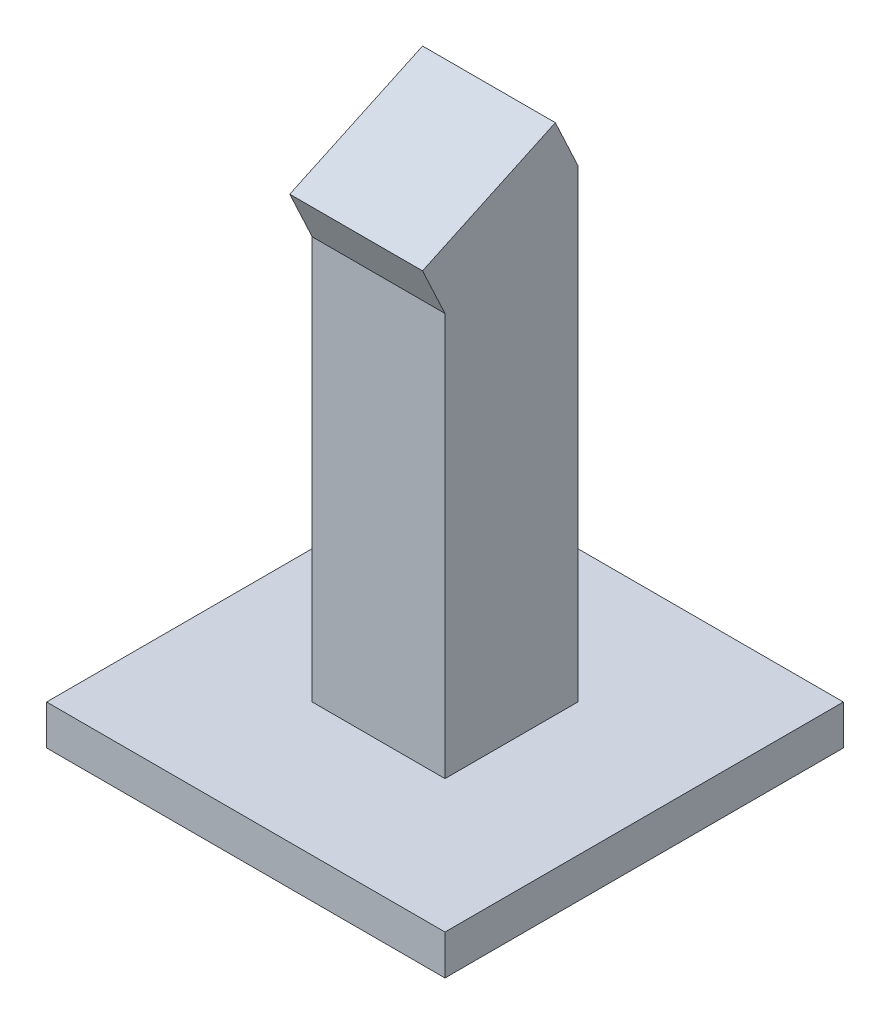
ISO-10303-21;
HEADER;
FILE_DESCRIPTION(('STEP AP214'),'2;1');
FILE_NAME('part.step','',(''),(''),'','','');
FILE_SCHEMA(('AUTOMOTIVE_DESIGN { 1 0 10303 214 1 1 1 1 }'));
ENDSEC;
DATA;
#1=APPLICATION_CONTEXT('core data for automotive mechanical design processes');
#2=APPLICATION_PROTOCOL_DEFINITION('international standard','automotive_design',2000,#1);
#3=PRODUCT_CONTEXT('',#1,'mechanical');
#4=PRODUCT('Part','Part','',(#3));
#5=PRODUCT_RELATED_PRODUCT_CATEGORY('part','',(#4));
#6=PRODUCT_DEFINITION_FORMATION('','',#4);
#7=PRODUCT_DEFINITION_CONTEXT('part definition',#1,'design');
#8=PRODUCT_DEFINITION('design','',#6,#7);
#9=PRODUCT_DEFINITION_SHAPE('','',#8);
#10=(LENGTH_UNIT() NAMED_UNIT(*) SI_UNIT(.MILLI.,.METRE.));
#11=(NAMED_UNIT(*) PLANE_ANGLE_UNIT() SI_UNIT($,.RADIAN.));
#12=(NAMED_UNIT(*) SI_UNIT($,.STERADIAN.) SOLID_ANGLE_UNIT());
#13=UNCERTAINTY_MEASURE_WITH_UNIT(LENGTH_MEASURE(1.E-05),#10,'distance_accuracy_value','');
#14=(GEOMETRIC_REPRESENTATION_CONTEXT(3) GLOBAL_UNCERTAINTY_ASSIGNED_CONTEXT((#13)) GLOBAL_UNIT_ASSIGNED_CONTEXT((#10,
#11,#12)) REPRESENTATION_CONTEXT('',''));
#15=CARTESIAN_POINT('',(0.,0.,0.));
#16=DIRECTION('',(0.,0.,1.));
#17=DIRECTION('',(1.,0.,0.));
#18=AXIS2_PLACEMENT_3D('',#15,#16,#17);
#19=CARTESIAN_POINT('',(0.,3.,0.));
#20=DIRECTION('',(1.,0.,0.));
#21=DIRECTION('',(0.,0.,-1.));
#22=AXIS2_PLACEMENT_3D('',#19,#20,#21);
#23=PLANE('',#22);
#24=DIRECTION('',(0.,0.,1.));
#25=VECTOR('',#24,1.);
#26=CARTESIAN_POINT('',(0.,0.,0.));
#27=LINE('',#26,#25);
#28=CARTESIAN_POINT('',(0.,0.,0.));
#29=VERTEX_POINT('',#28);
#30=CARTESIAN_POINT('',(0.,0.,30.));
#31=VERTEX_POINT('',#30);
#32=EDGE_CURVE('E180',#29,#31,#27,.T.);
#33=ORIENTED_EDGE('',*,*,#32,.T.);
#34=DIRECTION('',(0.,-1.,0.));
#35=VECTOR('',#34,1.);
#36=CARTESIAN_POINT('',(0.,3.,30.));
#37=LINE('',#36,#35);
#38=CARTESIAN_POINT('',(0.,3.,30.));
#39=VERTEX_POINT('',#38);
#40=EDGE_CURVE('E11',#39,#31,#37,.T.);
#41=ORIENTED_EDGE('',*,*,#40,.F.);
#42=DIRECTION('',(0.,0.,1.));
#43=VECTOR('',#42,1.);
#44=CARTESIAN_POINT('',(0.,3.,0.));
#45=LINE('',#44,#43);
#46=CARTESIAN_POINT('',(0.,3.,0.));
#47=VERTEX_POINT('',#46);
#48=EDGE_CURVE('E181',#47,#39,#45,.T.);
#49=ORIENTED_EDGE('',*,*,#48,.F.);
#50=DIRECTION('',(0.,-1.,0.));
#51=VECTOR('',#50,1.);
#52=CARTESIAN_POINT('',(0.,3.,0.));
#53=LINE('',#52,#51);
#54=EDGE_CURVE('E195',#47,#29,#53,.T.);
#55=ORIENTED_EDGE('',*,*,#54,.T.);
#56=EDGE_LOOP('',(#33,#41,#49,#55));
#57=FACE_BOUND('',#56,.T.);
#58=ADVANCED_FACE('F39',(#57),#23,.F.);
#59=CARTESIAN_POINT('',(0.,3.,30.));
#60=DIRECTION('',(0.,0.,-1.));
#61=DIRECTION('',(-1.,0.,0.));
#62=AXIS2_PLACEMENT_3D('',#59,#60,#61);
#63=PLANE('',#62);
#64=DIRECTION('',(1.,0.,0.));
#65=VECTOR('',#64,1.);
#66=CARTESIAN_POINT('',(0.,0.,30.));
#67=LINE('',#66,#65);
#68=CARTESIAN_POINT('',(30.,0.,30.));
#69=VERTEX_POINT('',#68);
#70=EDGE_CURVE('E199',#31,#69,#67,.T.);
#71=ORIENTED_EDGE('',*,*,#70,.T.);
#72=DIRECTION('',(0.,-1.,0.));
#73=VECTOR('',#72,1.);
#74=CARTESIAN_POINT('',(30.,3.,30.));
#75=LINE('',#74,#73);
#76=CARTESIAN_POINT('',(30.,3.,30.));
#77=VERTEX_POINT('',#76);
#78=EDGE_CURVE('E47',#77,#69,#75,.T.);
#79=ORIENTED_EDGE('',*,*,#78,.F.);
#80=DIRECTION('',(1.,0.,0.));
#81=VECTOR('',#80,1.);
#82=CARTESIAN_POINT('',(0.,3.,30.));
#83=LINE('',#82,#81);
#84=EDGE_CURVE('E185',#39,#77,#83,.T.);
#85=ORIENTED_EDGE('',*,*,#84,.F.);
#86=ORIENTED_EDGE('',*,*,#40,.T.);
#87=EDGE_LOOP('',(#71,#79,#85,#86));
#88=FACE_BOUND('',#87,.T.);
#89=ADVANCED_FACE('F235',(#88),#63,.F.);
#90=CARTESIAN_POINT('',(30.,3.,0.));
#91=DIRECTION('',(-1.,0.,0.));
#92=DIRECTION('',(0.,0.,1.));
#93=AXIS2_PLACEMENT_3D('',#90,#91,#92);
#94=PLANE('',#93);
#95=DIRECTION('',(0.,0.,-1.));
#96=VECTOR('',#95,1.);
#97=CARTESIAN_POINT('',(30.,0.,0.));
#98=LINE('',#97,#96);
#99=CARTESIAN_POINT('',(30.,0.,0.));
#100=VERTEX_POINT('',#99);
#101=EDGE_CURVE('E202',#69,#100,#98,.T.);
#102=ORIENTED_EDGE('',*,*,#101,.T.);
#103=DIRECTION('',(0.,-1.,0.));
#104=VECTOR('',#103,1.);
#105=CARTESIAN_POINT('',(30.,3.,0.));
#106=LINE('',#105,#104);
#107=CARTESIAN_POINT('',(30.,3.,0.));
#108=VERTEX_POINT('',#107);
#109=EDGE_CURVE('E210',#108,#100,#106,.T.);
#110=ORIENTED_EDGE('',*,*,#109,.F.);
#111=DIRECTION('',(0.,0.,-1.));
#112=VECTOR('',#111,1.);
#113=CARTESIAN_POINT('',(30.,3.,0.));
#114=LINE('',#113,#112);
#115=EDGE_CURVE('E189',#77,#108,#114,.T.);
#116=ORIENTED_EDGE('',*,*,#115,.F.);
#117=ORIENTED_EDGE('',*,*,#78,.T.);
#118=EDGE_LOOP('',(#102,#110,#116,#117));
#119=FACE_BOUND('',#118,.T.);
#120=ADVANCED_FACE('F219',(#119),#94,.F.);
#121=CARTESIAN_POINT('',(0.,3.,0.));
#122=DIRECTION('',(0.,0.,1.));
#123=DIRECTION('',(1.,0.,0.));
#124=AXIS2_PLACEMENT_3D('',#121,#122,#123);
#125=PLANE('',#124);
#126=DIRECTION('',(-1.,0.,0.));
#127=VECTOR('',#126,1.);
#128=CARTESIAN_POINT('',(0.,0.,0.));
#129=LINE('',#128,#127);
#130=EDGE_CURVE('E186',#100,#29,#129,.T.);
#131=ORIENTED_EDGE('',*,*,#130,.T.);
#132=ORIENTED_EDGE('',*,*,#54,.F.);
#133=DIRECTION('',(-1.,0.,0.));
#134=VECTOR('',#133,1.);
#135=CARTESIAN_POINT('',(0.,3.,0.));
#136=LINE('',#135,#134);
#137=EDGE_CURVE('E192',#108,#47,#136,.T.);
#138=ORIENTED_EDGE('',*,*,#137,.F.);
#139=ORIENTED_EDGE('',*,*,#109,.T.);
#140=EDGE_LOOP('',(#131,#132,#138,#139));
#141=FACE_BOUND('',#140,.T.);
#142=ADVANCED_FACE('F228',(#141),#125,.F.);
#143=CARTESIAN_POINT('',(0.,3.,0.));
#144=DIRECTION('',(0.,1.,0.));
#145=DIRECTION('',(0.,0.,1.));
#146=AXIS2_PLACEMENT_3D('',#143,#144,#145);
#147=PLANE('',#146);
#148=DIRECTION('',(0.,0.,1.));
#149=VECTOR('',#148,1.);
#150=CARTESIAN_POINT('',(10.,3.,10.));
#151=LINE('',#150,#149);
#152=CARTESIAN_POINT('',(10.,3.,10.));
#153=VERTEX_POINT('',#152);
#154=CARTESIAN_POINT('',(10.,3.,20.));
#155=VERTEX_POINT('',#154);
#156=EDGE_CURVE('E54',#153,#155,#151,.T.);
#157=ORIENTED_EDGE('',*,*,#156,.F.);
#158=DIRECTION('',(-1.,0.,0.));
#159=VECTOR('',#158,1.);
#160=CARTESIAN_POINT('',(10.,3.,10.));
#161=LINE('',#160,#159);
#162=CARTESIAN_POINT('',(20.,3.,10.));
#163=VERTEX_POINT('',#162);
#164=EDGE_CURVE('E58',#163,#153,#161,.T.);
#165=ORIENTED_EDGE('',*,*,#164,.F.);
#166=DIRECTION('',(0.,0.,-1.));
#167=VECTOR('',#166,1.);
#168=CARTESIAN_POINT('',(20.,3.,10.));
#169=LINE('',#168,#167);
#170=CARTESIAN_POINT('',(20.,3.,20.));
#171=VERTEX_POINT('',#170);
#172=EDGE_CURVE('E163',#171,#163,#169,.T.);
#173=ORIENTED_EDGE('',*,*,#172,.F.);
#174=DIRECTION('',(1.,0.,0.));
#175=VECTOR('',#174,1.);
#176=CARTESIAN_POINT('',(10.,3.,20.));
#177=LINE('',#176,#175);
#178=EDGE_CURVE('E159',#155,#171,#177,.T.);
#179=ORIENTED_EDGE('',*,*,#178,.F.);
#180=EDGE_LOOP('',(#157,#165,#173,#179));
#181=FACE_BOUND('',#180,.T.);
#182=ORIENTED_EDGE('',*,*,#48,.T.);
#183=ORIENTED_EDGE('',*,*,#84,.T.);
#184=ORIENTED_EDGE('',*,*,#115,.T.);
#185=ORIENTED_EDGE('',*,*,#137,.T.);
#186=EDGE_LOOP('',(#182,#183,#184,#185));
#187=FACE_BOUND('',#186,.T.);
#188=ADVANCED_FACE('F234',(#181,#187),#147,.T.);
#189=CARTESIAN_POINT('',(0.,0.,0.));
#190=DIRECTION('',(0.,1.,0.));
#191=DIRECTION('',(0.,0.,1.));
#192=AXIS2_PLACEMENT_3D('',#189,#190,#191);
#193=PLANE('',#192);
#194=ORIENTED_EDGE('',*,*,#32,.F.);
#195=ORIENTED_EDGE('',*,*,#130,.F.);
#196=ORIENTED_EDGE('',*,*,#101,.F.);
#197=ORIENTED_EDGE('',*,*,#70,.F.);
#198=EDGE_LOOP('',(#194,#195,#196,#197));
#199=FACE_BOUND('',#198,.T.);
#200=ADVANCED_FACE('F225',(#199),#193,.F.);
#201=CARTESIAN_POINT('',(10.,38.,10.));
#202=DIRECTION('',(1.,0.,0.));
#203=DIRECTION('',(0.,0.,-1.));
#204=AXIS2_PLACEMENT_3D('',#201,#202,#203);
#205=PLANE('',#204);
#206=DIRECTION('',(0.,-1.,0.));
#207=VECTOR('',#206,1.);
#208=CARTESIAN_POINT('',(10.,38.,20.));
#209=LINE('',#208,#207);
#210=CARTESIAN_POINT('',(10.,33.3369234184501,20.));
#211=VERTEX_POINT('',#210);
#212=EDGE_CURVE('E141',#211,#155,#209,.T.);
#213=ORIENTED_EDGE('',*,*,#212,.F.);
#214=DIRECTION('',(0.,-0.906307787036653,-0.422618261740694));
#215=VECTOR('',#214,1.);
#216=CARTESIAN_POINT('',(10.,36.9621545665967,21.6904730469628));
#217=LINE('',#216,#215);
#218=CARTESIAN_POINT('',(10.,36.9621545665967,21.6904730469628));
#219=VERTEX_POINT('',#218);
#220=EDGE_CURVE('E121',#219,#211,#217,.T.);
#221=ORIENTED_EDGE('',*,*,#220,.F.);
#222=DIRECTION('',(0.,-0.422618261740694,0.906307787036653));
#223=VECTOR('',#222,1.);
#224=CARTESIAN_POINT('',(10.,41.6252311481466,11.6904730469628));
#225=LINE('',#224,#223);
#226=CARTESIAN_POINT('',(10.,41.6252311481466,11.6904730469628));
#227=VERTEX_POINT('',#226);
#228=EDGE_CURVE('E128',#227,#219,#225,.T.);
#229=ORIENTED_EDGE('',*,*,#228,.F.);
#230=DIRECTION('',(0.,-0.906307787036653,-0.422618261740694));
#231=VECTOR('',#230,1.);
#232=CARTESIAN_POINT('',(10.,41.6252311481466,11.6904730469628));
#233=LINE('',#232,#231);
#234=CARTESIAN_POINT('',(10.,38.,10.));
#235=VERTEX_POINT('',#234);
#236=EDGE_CURVE('E354',#227,#235,#233,.T.);
#237=ORIENTED_EDGE('',*,*,#236,.T.);
#238=DIRECTION('',(0.,-1.,0.));
#239=VECTOR('',#238,1.);
#240=CARTESIAN_POINT('',(10.,38.,10.));
#241=LINE('',#240,#239);
#242=EDGE_CURVE('E156',#235,#153,#241,.T.);
#243=ORIENTED_EDGE('',*,*,#242,.T.);
#244=ORIENTED_EDGE('',*,*,#156,.T.);
#245=EDGE_LOOP('',(#213,#221,#229,#237,#243,#244));
#246=FACE_BOUND('',#245,.T.);
#247=ADVANCED_FACE('F140',(#246),#205,.F.);
#248=CARTESIAN_POINT('',(10.,38.,20.));
#249=DIRECTION('',(0.,0.,-1.));
#250=DIRECTION('',(-1.,0.,0.));
#251=AXIS2_PLACEMENT_3D('',#248,#249,#250);
#252=PLANE('',#251);
#253=DIRECTION('',(0.,-1.,0.));
#254=VECTOR('',#253,1.);
#255=CARTESIAN_POINT('',(20.,38.,20.));
#256=LINE('',#255,#254);
#257=CARTESIAN_POINT('',(20.,33.3369234184501,20.));
#258=VERTEX_POINT('',#257);
#259=EDGE_CURVE('E175',#258,#171,#256,.T.);
#260=ORIENTED_EDGE('',*,*,#259,.F.);
#261=DIRECTION('',(1.,0.,0.));
#262=VECTOR('',#261,1.);
#263=CARTESIAN_POINT('',(0.,33.3369234184501,20.));
#264=LINE('',#263,#262);
#265=EDGE_CURVE('E143',#211,#258,#264,.T.);
#266=ORIENTED_EDGE('',*,*,#265,.F.);
#267=ORIENTED_EDGE('',*,*,#212,.T.);
#268=ORIENTED_EDGE('',*,*,#178,.T.);
#269=EDGE_LOOP('',(#260,#266,#267,#268));
#270=FACE_BOUND('',#269,.T.);
#271=ADVANCED_FACE('F251',(#270),#252,.F.);
#272=CARTESIAN_POINT('',(20.,38.,10.));
#273=DIRECTION('',(-1.,0.,0.));
#274=DIRECTION('',(0.,0.,1.));
#275=AXIS2_PLACEMENT_3D('',#272,#273,#274);
#276=PLANE('',#275);
#277=DIRECTION('',(0.,-1.,0.));
#278=VECTOR('',#277,1.);
#279=CARTESIAN_POINT('',(20.,38.,10.));
#280=LINE('',#279,#278);
#281=CARTESIAN_POINT('',(20.,38.,10.));
#282=VERTEX_POINT('',#281);
#283=EDGE_CURVE('E171',#282,#163,#280,.T.);
#284=ORIENTED_EDGE('',*,*,#283,.F.);
#285=DIRECTION('',(0.,-0.906307787036653,-0.422618261740694));
#286=VECTOR('',#285,1.);
#287=CARTESIAN_POINT('',(20.,41.6252311481466,11.6904730469628));
#288=LINE('',#287,#286);
#289=CARTESIAN_POINT('',(20.,41.6252311481466,11.6904730469628));
#290=VERTEX_POINT('',#289);
#291=EDGE_CURVE('E148',#290,#282,#288,.T.);
#292=ORIENTED_EDGE('',*,*,#291,.F.);
#293=DIRECTION('',(0.,0.422618261740694,-0.906307787036653));
#294=VECTOR('',#293,1.);
#295=CARTESIAN_POINT('',(20.,41.6252311481466,11.6904730469628));
#296=LINE('',#295,#294);
#297=CARTESIAN_POINT('',(20.,36.9621545665967,21.6904730469628));
#298=VERTEX_POINT('',#297);
#299=EDGE_CURVE('E127',#298,#290,#296,.T.);
#300=ORIENTED_EDGE('',*,*,#299,.F.);
#301=DIRECTION('',(0.,-0.906307787036653,-0.422618261740694));
#302=VECTOR('',#301,1.);
#303=CARTESIAN_POINT('',(20.,36.9621545665967,21.6904730469628));
#304=LINE('',#303,#302);
#305=EDGE_CURVE('E123',#298,#258,#304,.T.);
#306=ORIENTED_EDGE('',*,*,#305,.T.);
#307=ORIENTED_EDGE('',*,*,#259,.T.);
#308=ORIENTED_EDGE('',*,*,#172,.T.);
#309=EDGE_LOOP('',(#284,#292,#300,#306,#307,#308));
#310=FACE_BOUND('',#309,.T.);
#311=ADVANCED_FACE('F254',(#310),#276,.F.);
#312=CARTESIAN_POINT('',(10.,38.,10.));
#313=DIRECTION('',(0.,0.,1.));
#314=DIRECTION('',(1.,0.,0.));
#315=AXIS2_PLACEMENT_3D('',#312,#313,#314);
#316=PLANE('',#315);
#317=ORIENTED_EDGE('',*,*,#164,.T.);
#318=ORIENTED_EDGE('',*,*,#242,.F.);
#319=DIRECTION('',(-1.,0.,0.));
#320=VECTOR('',#319,1.);
#321=CARTESIAN_POINT('',(10.,38.,10.));
#322=LINE('',#321,#320);
#323=EDGE_CURVE('E152',#282,#235,#322,.T.);
#324=ORIENTED_EDGE('',*,*,#323,.F.);
#325=ORIENTED_EDGE('',*,*,#283,.T.);
#326=EDGE_LOOP('',(#317,#318,#324,#325));
#327=FACE_BOUND('',#326,.T.);
#328=ADVANCED_FACE('F258',(#327),#316,.F.);
#329=CARTESIAN_POINT('',(10.,36.9621545665967,21.6904730469628));
#330=DIRECTION('',(0.,0.422618261740694,-0.906307787036653));
#331=DIRECTION('',(0.,0.906307787036653,0.422618261740694));
#332=AXIS2_PLACEMENT_3D('',#329,#330,#331);
#333=PLANE('',#332);
#334=ORIENTED_EDGE('',*,*,#265,.T.);
#335=ORIENTED_EDGE('',*,*,#305,.F.);
#336=DIRECTION('',(1.,0.,0.));
#337=VECTOR('',#336,1.);
#338=CARTESIAN_POINT('',(10.,36.9621545665967,21.6904730469628));
#339=LINE('',#338,#337);
#340=EDGE_CURVE('E116',#219,#298,#339,.T.);
#341=ORIENTED_EDGE('',*,*,#340,.F.);
#342=ORIENTED_EDGE('',*,*,#220,.T.);
#343=EDGE_LOOP('',(#334,#335,#341,#342));
#344=FACE_BOUND('',#343,.T.);
#345=ADVANCED_FACE('F119',(#344),#333,.F.);
#346=CARTESIAN_POINT('',(10.,41.6252311481466,11.6904730469628));
#347=DIRECTION('',(0.,-0.422618261740694,0.906307787036653));
#348=DIRECTION('',(0.,-0.906307787036653,-0.422618261740694));
#349=AXIS2_PLACEMENT_3D('',#346,#347,#348);
#350=PLANE('',#349);
#351=ORIENTED_EDGE('',*,*,#323,.T.);
#352=ORIENTED_EDGE('',*,*,#236,.F.);
#353=DIRECTION('',(-1.,0.,0.));
#354=VECTOR('',#353,1.);
#355=CARTESIAN_POINT('',(10.,41.6252311481466,11.6904730469628));
#356=LINE('',#355,#354);
#357=EDGE_CURVE('E133',#290,#227,#356,.T.);
#358=ORIENTED_EDGE('',*,*,#357,.F.);
#359=ORIENTED_EDGE('',*,*,#291,.T.);
#360=EDGE_LOOP('',(#351,#352,#358,#359));
#361=FACE_BOUND('',#360,.T.);
#362=ADVANCED_FACE('F265',(#361),#350,.F.);
#363=CARTESIAN_POINT('',(0.,38.6684179477859,18.0313794177905));
#364=DIRECTION('',(0.,0.906307787036653,0.422618261740694));
#365=DIRECTION('',(0.,-0.422618261740694,0.906307787036653));
#366=AXIS2_PLACEMENT_3D('',#363,#364,#365);
#367=PLANE('',#366);
#368=ORIENTED_EDGE('',*,*,#228,.T.);
#369=ORIENTED_EDGE('',*,*,#340,.T.);
#370=ORIENTED_EDGE('',*,*,#299,.T.);
#371=ORIENTED_EDGE('',*,*,#357,.T.);
#372=EDGE_LOOP('',(#368,#369,#370,#371));
#373=FACE_BOUND('',#372,.T.);
#374=ADVANCED_FACE('F131',(#373),#367,.T.);
#375=CLOSED_SHELL('',(#58,#89,#120,#142,#188,#200,#247,#271,#311,#328,#345,#362,#374));
#376=MANIFOLD_SOLID_BREP('B2',#375);
#377=ADVANCED_BREP_SHAPE_REPRESENTATION('',(#18,#376),#14);
#378=SHAPE_DEFINITION_REPRESENTATION(#9,#377);
ENDSEC;
END-ISO-10303-21;
